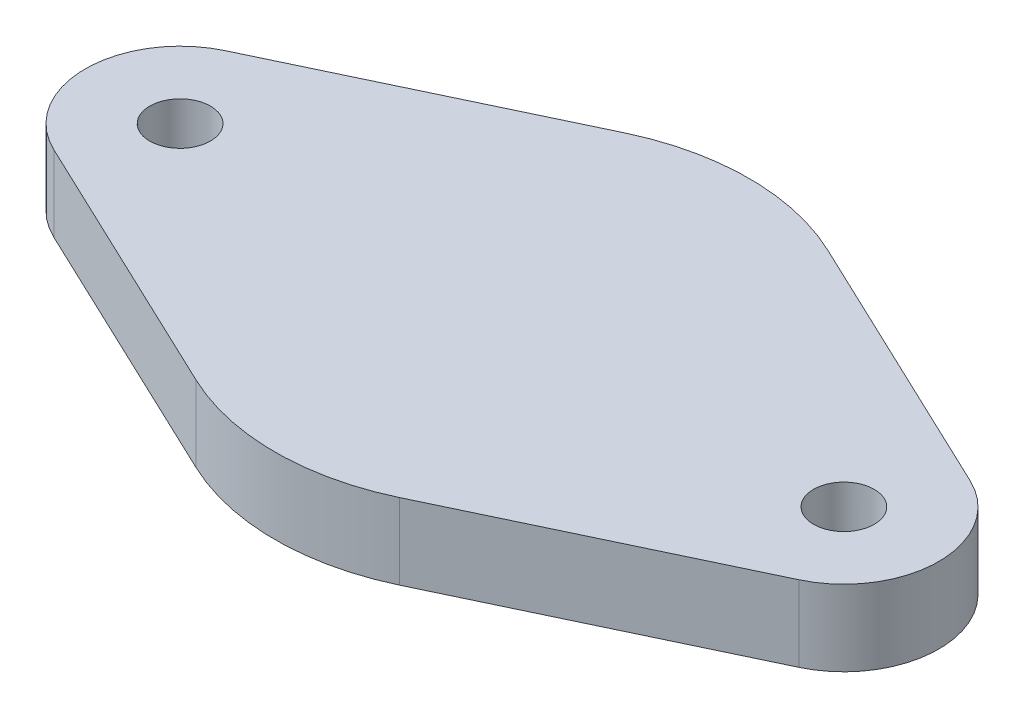
ISO-10303-21;
HEADER;
FILE_DESCRIPTION(('STEP AP214'),'2;1');
FILE_NAME('part.step','',(''),(''),'','','');
FILE_SCHEMA(('AUTOMOTIVE_DESIGN { 1 0 10303 214 1 1 1 1 }'));
ENDSEC;
DATA;
#1=APPLICATION_CONTEXT('core data for automotive mechanical design processes');
#2=APPLICATION_PROTOCOL_DEFINITION('international standard','automotive_design',2000,#1);
#3=PRODUCT_CONTEXT('',#1,'mechanical');
#4=PRODUCT('Part','Part','',(#3));
#5=PRODUCT_RELATED_PRODUCT_CATEGORY('part','',(#4));
#6=PRODUCT_DEFINITION_FORMATION('','',#4);
#7=PRODUCT_DEFINITION_CONTEXT('part definition',#1,'design');
#8=PRODUCT_DEFINITION('design','',#6,#7);
#9=PRODUCT_DEFINITION_SHAPE('','',#8);
#10=(LENGTH_UNIT() NAMED_UNIT(*) SI_UNIT(.MILLI.,.METRE.));
#11=(NAMED_UNIT(*) PLANE_ANGLE_UNIT() SI_UNIT($,.RADIAN.));
#12=(NAMED_UNIT(*) SI_UNIT($,.STERADIAN.) SOLID_ANGLE_UNIT());
#13=UNCERTAINTY_MEASURE_WITH_UNIT(LENGTH_MEASURE(1.E-05),#10,'distance_accuracy_value','');
#14=(GEOMETRIC_REPRESENTATION_CONTEXT(3) GLOBAL_UNCERTAINTY_ASSIGNED_CONTEXT((#13)) GLOBAL_UNIT_ASSIGNED_CONTEXT((#10,
#11,#12)) REPRESENTATION_CONTEXT('',''));
#15=CARTESIAN_POINT('',(0.,0.,0.));
#16=DIRECTION('',(0.,0.,1.));
#17=DIRECTION('',(1.,0.,0.));
#18=AXIS2_PLACEMENT_3D('',#15,#16,#17);
#19=CARTESIAN_POINT('',(0.,12.495,0.));
#20=DIRECTION('',(0.,1.,0.));
#21=DIRECTION('',(0.,0.,1.));
#22=AXIS2_PLACEMENT_3D('',#19,#20,#21);
#23=CYLINDRICAL_SURFACE('',#22,12.5);
#24=DIRECTION('',(0.,1.,0.));
#25=VECTOR('',#24,1.);
#26=CARTESIAN_POINT('',(5.35714285714285,-20.4563332018274,-11.2938487863156));
#27=LINE('',#26,#25);
#28=CARTESIAN_POINT('',(5.35714285714285,7.9,-11.2938487863156));
#29=VERTEX_POINT('',#28);
#30=CARTESIAN_POINT('',(5.35714285714286,11.9,-11.2938487863156));
#31=VERTEX_POINT('',#30);
#32=EDGE_CURVE('E188',#29,#31,#27,.T.);
#33=ORIENTED_EDGE('',*,*,#32,.F.);
#34=CARTESIAN_POINT('',(0.,7.9,0.));
#35=DIRECTION('',(0.,1.,0.));
#36=DIRECTION('',(0.,0.,1.));
#37=AXIS2_PLACEMENT_3D('',#34,#35,#36);
#38=CIRCLE('',#37,12.5);
#39=CARTESIAN_POINT('',(-5.35714285714285,7.9,-11.2938487863156));
#40=VERTEX_POINT('',#39);
#41=EDGE_CURVE('E131',#29,#40,#38,.T.);
#42=ORIENTED_EDGE('',*,*,#41,.T.);
#43=DIRECTION('',(0.,1.,0.));
#44=VECTOR('',#43,1.);
#45=CARTESIAN_POINT('',(-5.35714285714285,-20.4563332018274,-11.2938487863156));
#46=LINE('',#45,#44);
#47=CARTESIAN_POINT('',(-5.35714285714285,11.9,-11.2938487863156));
#48=VERTEX_POINT('',#47);
#49=EDGE_CURVE('E143',#40,#48,#46,.T.);
#50=ORIENTED_EDGE('',*,*,#49,.T.);
#51=CARTESIAN_POINT('',(0.,11.9,0.));
#52=DIRECTION('',(0.,1.,0.));
#53=DIRECTION('',(0.,0.,1.));
#54=AXIS2_PLACEMENT_3D('',#51,#52,#53);
#55=CIRCLE('',#54,12.5);
#56=EDGE_CURVE('E132',#31,#48,#55,.T.);
#57=ORIENTED_EDGE('',*,*,#56,.F.);
#58=EDGE_LOOP('',(#33,#42,#50,#57));
#59=FACE_BOUND('',#58,.T.);
#60=ADVANCED_FACE('F39',(#59),#23,.T.);
#61=CARTESIAN_POINT('',(0.,0.,0.));
#62=DIRECTION('',(0.,1.,0.));
#63=DIRECTION('',(1.,0.,0.));
#64=AXIS2_PLACEMENT_3D('',#61,#62,#63);
#65=SPHERICAL_SURFACE('',#64,10.25);
#66=CARTESIAN_POINT('',(0.,7.9,0.));
#67=DIRECTION('',(0.,1.,0.));
#68=DIRECTION('',(0.,0.,1.));
#69=AXIS2_PLACEMENT_3D('',#66,#67,#68);
#70=CIRCLE('',#69,6.53088814787086);
#71=CARTESIAN_POINT('',(0.,7.9,6.53088814787086));
#72=VERTEX_POINT('',#71);
#73=EDGE_CURVE('E11',#72,#72,#70,.T.);
#74=ORIENTED_EDGE('',*,*,#73,.F.);
#75=EDGE_LOOP('',(#74));
#76=FACE_BOUND('',#75,.T.);
#77=ADVANCED_FACE('F41',(#76),#65,.F.);
#78=CARTESIAN_POINT('',(0.,7.9,0.));
#79=DIRECTION('',(0.,1.,0.));
#80=DIRECTION('',(0.,0.,1.));
#81=AXIS2_PLACEMENT_3D('',#78,#79,#80);
#82=PLANE('',#81);
#83=CARTESIAN_POINT('',(-5.35714285714285,7.9,11.2938487863156));
#84=VERTEX_POINT('',#83);
#85=CARTESIAN_POINT('',(5.35714285714285,7.9,11.2938487863156));
#86=VERTEX_POINT('',#85);
#87=EDGE_CURVE('E48',#84,#86,#38,.T.);
#88=ORIENTED_EDGE('',*,*,#87,.F.);
#89=DIRECTION('',(-0.903507902905251,0.,-0.428571428571428));
#90=VECTOR('',#89,1.);
#91=CARTESIAN_POINT('',(-5.35714285714285,7.9,11.2938487863156));
#92=LINE('',#91,#90);
#93=CARTESIAN_POINT('',(-19.6428571428571,7.9,4.51753951452626));
#94=VERTEX_POINT('',#93);
#95=EDGE_CURVE('E171',#84,#94,#92,.T.);
#96=ORIENTED_EDGE('',*,*,#95,.T.);
#97=CARTESIAN_POINT('',(-17.5,7.9,0.));
#98=DIRECTION('',(0.,1.,0.));
#99=DIRECTION('',(0.,0.,1.));
#100=AXIS2_PLACEMENT_3D('',#97,#98,#99);
#101=CIRCLE('',#100,5.);
#102=CARTESIAN_POINT('',(-19.6428571428571,7.9,-4.51753951452626));
#103=VERTEX_POINT('',#102);
#104=EDGE_CURVE('E156',#94,#103,#101,.F.);
#105=ORIENTED_EDGE('',*,*,#104,.T.);
#106=DIRECTION('',(0.903507902905251,0.,-0.428571428571428));
#107=VECTOR('',#106,1.);
#108=CARTESIAN_POINT('',(-5.35714285714285,7.9,-11.2938487863156));
#109=LINE('',#108,#107);
#110=EDGE_CURVE('E142',#103,#40,#109,.T.);
#111=ORIENTED_EDGE('',*,*,#110,.T.);
#112=ORIENTED_EDGE('',*,*,#41,.F.);
#113=DIRECTION('',(0.903507902905251,0.,0.428571428571428));
#114=VECTOR('',#113,1.);
#115=CARTESIAN_POINT('',(5.35714285714285,7.9,-11.2938487863156));
#116=LINE('',#115,#114);
#117=CARTESIAN_POINT('',(19.6428571428571,7.9,-4.51753951452626));
#118=VERTEX_POINT('',#117);
#119=EDGE_CURVE('E199',#29,#118,#116,.T.);
#120=ORIENTED_EDGE('',*,*,#119,.T.);
#121=CARTESIAN_POINT('',(17.5,7.9,0.));
#122=DIRECTION('',(0.,1.,0.));
#123=DIRECTION('',(0.,0.,1.));
#124=AXIS2_PLACEMENT_3D('',#121,#122,#123);
#125=CIRCLE('',#124,5.);
#126=CARTESIAN_POINT('',(19.6428571428571,7.9,4.51753951452626));
#127=VERTEX_POINT('',#126);
#128=EDGE_CURVE('E191',#118,#127,#125,.F.);
#129=ORIENTED_EDGE('',*,*,#128,.T.);
#130=DIRECTION('',(-0.903507902905251,0.,0.428571428571428));
#131=VECTOR('',#130,1.);
#132=CARTESIAN_POINT('',(5.35714285714285,7.9,11.2938487863156));
#133=LINE('',#132,#131);
#134=EDGE_CURVE('E181',#127,#86,#133,.T.);
#135=ORIENTED_EDGE('',*,*,#134,.T.);
#136=EDGE_LOOP('',(#88,#96,#105,#111,#112,#120,#129,#135));
#137=FACE_BOUND('',#136,.T.);
#138=ORIENTED_EDGE('',*,*,#73,.T.);
#139=EDGE_LOOP('',(#138));
#140=FACE_BOUND('',#139,.T.);
#141=CARTESIAN_POINT('',(-17.5,7.9,0.));
#142=DIRECTION('',(0.,1.,0.));
#143=DIRECTION('',(0.,0.,1.));
#144=AXIS2_PLACEMENT_3D('',#141,#142,#143);
#145=CIRCLE('',#144,1.6);
#146=CARTESIAN_POINT('',(-17.5,7.9,1.6));
#147=VERTEX_POINT('',#146);
#148=EDGE_CURVE('E136',#147,#147,#145,.F.);
#149=ORIENTED_EDGE('',*,*,#148,.F.);
#150=EDGE_LOOP('',(#149));
#151=FACE_BOUND('',#150,.T.);
#152=CARTESIAN_POINT('',(17.5,7.9,0.));
#153=DIRECTION('',(0.,1.,0.));
#154=DIRECTION('',(0.,0.,1.));
#155=AXIS2_PLACEMENT_3D('',#152,#153,#154);
#156=CIRCLE('',#155,1.6);
#157=CARTESIAN_POINT('',(17.5,7.9,1.6));
#158=VERTEX_POINT('',#157);
#159=EDGE_CURVE('E170',#158,#158,#156,.F.);
#160=ORIENTED_EDGE('',*,*,#159,.F.);
#161=EDGE_LOOP('',(#160));
#162=FACE_BOUND('',#161,.T.);
#163=ADVANCED_FACE('F206',(#137,#140,#151,#162),#82,.F.);
#164=ORIENTED_EDGE('',*,*,#87,.T.);
#165=DIRECTION('',(0.,1.,0.));
#166=VECTOR('',#165,1.);
#167=CARTESIAN_POINT('',(5.35714285714285,-20.4563332018274,11.2938487863156));
#168=LINE('',#167,#166);
#169=CARTESIAN_POINT('',(5.35714285714285,11.9,11.2938487863156));
#170=VERTEX_POINT('',#169);
#171=EDGE_CURVE('E111',#86,#170,#168,.T.);
#172=ORIENTED_EDGE('',*,*,#171,.T.);
#173=CARTESIAN_POINT('',(-5.35714285714286,11.9,11.2938487863156));
#174=VERTEX_POINT('',#173);
#175=EDGE_CURVE('E124',#174,#170,#55,.T.);
#176=ORIENTED_EDGE('',*,*,#175,.F.);
#177=DIRECTION('',(0.,1.,0.));
#178=VECTOR('',#177,1.);
#179=CARTESIAN_POINT('',(-5.35714285714285,-20.4563332018274,11.2938487863156));
#180=LINE('',#179,#178);
#181=EDGE_CURVE('E153',#84,#174,#180,.T.);
#182=ORIENTED_EDGE('',*,*,#181,.F.);
#183=EDGE_LOOP('',(#164,#172,#176,#182));
#184=FACE_BOUND('',#183,.T.);
#185=ADVANCED_FACE('F122',(#184),#23,.T.);
#186=CARTESIAN_POINT('',(0.,11.9,0.));
#187=DIRECTION('',(0.,1.,0.));
#188=DIRECTION('',(0.,0.,1.));
#189=AXIS2_PLACEMENT_3D('',#186,#187,#188);
#190=PLANE('',#189);
#191=ORIENTED_EDGE('',*,*,#175,.T.);
#192=DIRECTION('',(0.903507902905252,0.,-0.428571428571428));
#193=VECTOR('',#192,1.);
#194=CARTESIAN_POINT('',(5.35714285714285,11.9,11.2938487863156));
#195=LINE('',#194,#193);
#196=CARTESIAN_POINT('',(19.6428571428571,11.9,4.51753951452626));
#197=VERTEX_POINT('',#196);
#198=EDGE_CURVE('E107',#170,#197,#195,.T.);
#199=ORIENTED_EDGE('',*,*,#198,.T.);
#200=CARTESIAN_POINT('',(17.5,11.9,0.));
#201=DIRECTION('',(0.,1.,0.));
#202=DIRECTION('',(0.,0.,-1.));
#203=AXIS2_PLACEMENT_3D('',#200,#201,#202);
#204=CIRCLE('',#203,5.);
#205=CARTESIAN_POINT('',(19.6428571428571,11.9,-4.51753951452626));
#206=VERTEX_POINT('',#205);
#207=EDGE_CURVE('E117',#197,#206,#204,.T.);
#208=ORIENTED_EDGE('',*,*,#207,.T.);
#209=DIRECTION('',(-0.903507902905252,0.,-0.428571428571428));
#210=VECTOR('',#209,1.);
#211=CARTESIAN_POINT('',(5.35714285714285,11.9,-11.2938487863156));
#212=LINE('',#211,#210);
#213=EDGE_CURVE('E55',#206,#31,#212,.T.);
#214=ORIENTED_EDGE('',*,*,#213,.T.);
#215=ORIENTED_EDGE('',*,*,#56,.T.);
#216=DIRECTION('',(-0.903507902905252,0.,0.428571428571428));
#217=VECTOR('',#216,1.);
#218=CARTESIAN_POINT('',(-5.35714285714285,11.9,-11.2938487863156));
#219=LINE('',#218,#217);
#220=CARTESIAN_POINT('',(-19.6428571428571,11.9,-4.51753951452626));
#221=VERTEX_POINT('',#220);
#222=EDGE_CURVE('E162',#48,#221,#219,.T.);
#223=ORIENTED_EDGE('',*,*,#222,.T.);
#224=CARTESIAN_POINT('',(-17.5,11.9,0.));
#225=DIRECTION('',(0.,1.,0.));
#226=DIRECTION('',(0.,0.,1.));
#227=AXIS2_PLACEMENT_3D('',#224,#225,#226);
#228=CIRCLE('',#227,5.);
#229=CARTESIAN_POINT('',(-19.6428571428571,11.9,4.51753951452626));
#230=VERTEX_POINT('',#229);
#231=EDGE_CURVE('E159',#221,#230,#228,.T.);
#232=ORIENTED_EDGE('',*,*,#231,.T.);
#233=DIRECTION('',(0.903507902905252,0.,0.428571428571428));
#234=VECTOR('',#233,1.);
#235=CARTESIAN_POINT('',(-5.35714285714285,11.9,11.2938487863156));
#236=LINE('',#235,#234);
#237=EDGE_CURVE('E62',#230,#174,#236,.T.);
#238=ORIENTED_EDGE('',*,*,#237,.T.);
#239=EDGE_LOOP('',(#191,#199,#208,#214,#215,#223,#232,#238));
#240=FACE_BOUND('',#239,.T.);
#241=CARTESIAN_POINT('',(-17.5,11.9,0.));
#242=DIRECTION('',(0.,1.,0.));
#243=DIRECTION('',(0.,0.,1.));
#244=AXIS2_PLACEMENT_3D('',#241,#242,#243);
#245=CIRCLE('',#244,1.6);
#246=CARTESIAN_POINT('',(-17.5,11.9,1.6));
#247=VERTEX_POINT('',#246);
#248=EDGE_CURVE('E166',#247,#247,#245,.T.);
#249=ORIENTED_EDGE('',*,*,#248,.F.);
#250=EDGE_LOOP('',(#249));
#251=FACE_BOUND('',#250,.T.);
#252=CARTESIAN_POINT('',(17.5,11.9,0.));
#253=DIRECTION('',(0.,1.,0.));
#254=DIRECTION('',(0.,0.,-1.));
#255=AXIS2_PLACEMENT_3D('',#252,#253,#254);
#256=CIRCLE('',#255,1.6);
#257=CARTESIAN_POINT('',(17.5,11.9,-1.6));
#258=VERTEX_POINT('',#257);
#259=EDGE_CURVE('E118',#258,#258,#256,.T.);
#260=ORIENTED_EDGE('',*,*,#259,.F.);
#261=EDGE_LOOP('',(#260));
#262=FACE_BOUND('',#261,.T.);
#263=ADVANCED_FACE('F128',(#240,#251,#262),#190,.T.);
#264=CARTESIAN_POINT('',(-5.35714285714285,-20.4563332018274,-11.2938487863156));
#265=DIRECTION('',(-0.428571428571428,0.,-0.903507902905251));
#266=DIRECTION('',(-0.903507902905251,0.,0.428571428571428));
#267=AXIS2_PLACEMENT_3D('',#264,#265,#266);
#268=PLANE('',#267);
#269=ORIENTED_EDGE('',*,*,#110,.F.);
#270=DIRECTION('',(0.,1.,0.));
#271=VECTOR('',#270,1.);
#272=CARTESIAN_POINT('',(-19.6428571428571,-20.4563332018274,-4.51753951452626));
#273=LINE('',#272,#271);
#274=EDGE_CURVE('E147',#103,#221,#273,.T.);
#275=ORIENTED_EDGE('',*,*,#274,.T.);
#276=ORIENTED_EDGE('',*,*,#222,.F.);
#277=ORIENTED_EDGE('',*,*,#49,.F.);
#278=EDGE_LOOP('',(#269,#275,#276,#277));
#279=FACE_BOUND('',#278,.T.);
#280=ADVANCED_FACE('F222',(#279),#268,.T.);
#281=CARTESIAN_POINT('',(-17.5,-20.4563332018274,0.));
#282=DIRECTION('',(0.,1.,0.));
#283=DIRECTION('',(0.,0.,1.));
#284=AXIS2_PLACEMENT_3D('',#281,#282,#283);
#285=CYLINDRICAL_SURFACE('',#284,5.);
#286=ORIENTED_EDGE('',*,*,#104,.F.);
#287=DIRECTION('',(0.,1.,0.));
#288=VECTOR('',#287,1.);
#289=CARTESIAN_POINT('',(-19.6428571428571,-20.4563332018274,4.51753951452626));
#290=LINE('',#289,#288);
#291=EDGE_CURVE('E150',#94,#230,#290,.T.);
#292=ORIENTED_EDGE('',*,*,#291,.T.);
#293=ORIENTED_EDGE('',*,*,#231,.F.);
#294=ORIENTED_EDGE('',*,*,#274,.F.);
#295=EDGE_LOOP('',(#286,#292,#293,#294));
#296=FACE_BOUND('',#295,.T.);
#297=ADVANCED_FACE('F227',(#296),#285,.T.);
#298=CARTESIAN_POINT('',(-5.35714285714285,-20.4563332018274,11.2938487863156));
#299=DIRECTION('',(-0.428571428571428,0.,0.903507902905251));
#300=DIRECTION('',(0.903507902905251,0.,0.428571428571428));
#301=AXIS2_PLACEMENT_3D('',#298,#299,#300);
#302=PLANE('',#301);
#303=ORIENTED_EDGE('',*,*,#95,.F.);
#304=ORIENTED_EDGE('',*,*,#181,.T.);
#305=ORIENTED_EDGE('',*,*,#237,.F.);
#306=ORIENTED_EDGE('',*,*,#291,.F.);
#307=EDGE_LOOP('',(#303,#304,#305,#306));
#308=FACE_BOUND('',#307,.T.);
#309=ADVANCED_FACE('F230',(#308),#302,.T.);
#310=CARTESIAN_POINT('',(-17.5,-20.4563332018274,0.));
#311=DIRECTION('',(0.,1.,0.));
#312=DIRECTION('',(0.,0.,1.));
#313=AXIS2_PLACEMENT_3D('',#310,#311,#312);
#314=CYLINDRICAL_SURFACE('',#313,1.6);
#315=ORIENTED_EDGE('',*,*,#148,.T.);
#316=EDGE_LOOP('',(#315));
#317=FACE_BOUND('',#316,.T.);
#318=ORIENTED_EDGE('',*,*,#248,.T.);
#319=EDGE_LOOP('',(#318));
#320=FACE_BOUND('',#319,.T.);
#321=ADVANCED_FACE('F232',(#317,#320),#314,.F.);
#322=CARTESIAN_POINT('',(5.35714285714285,-20.4563332018274,11.2938487863156));
#323=DIRECTION('',(0.428571428571428,0.,0.903507902905251));
#324=DIRECTION('',(0.903507902905251,0.,-0.428571428571428));
#325=AXIS2_PLACEMENT_3D('',#322,#323,#324);
#326=PLANE('',#325);
#327=ORIENTED_EDGE('',*,*,#134,.F.);
#328=DIRECTION('',(0.,1.,0.));
#329=VECTOR('',#328,1.);
#330=CARTESIAN_POINT('',(19.6428571428571,-20.4563332018274,4.51753951452626));
#331=LINE('',#330,#329);
#332=EDGE_CURVE('E114',#127,#197,#331,.T.);
#333=ORIENTED_EDGE('',*,*,#332,.T.);
#334=ORIENTED_EDGE('',*,*,#198,.F.);
#335=ORIENTED_EDGE('',*,*,#171,.F.);
#336=EDGE_LOOP('',(#327,#333,#334,#335));
#337=FACE_BOUND('',#336,.T.);
#338=ADVANCED_FACE('F110',(#337),#326,.T.);
#339=CARTESIAN_POINT('',(17.5,-20.4563332018274,0.));
#340=DIRECTION('',(0.,1.,0.));
#341=DIRECTION('',(0.,0.,1.));
#342=AXIS2_PLACEMENT_3D('',#339,#340,#341);
#343=CYLINDRICAL_SURFACE('',#342,5.);
#344=ORIENTED_EDGE('',*,*,#128,.F.);
#345=DIRECTION('',(0.,1.,0.));
#346=VECTOR('',#345,1.);
#347=CARTESIAN_POINT('',(19.6428571428571,-20.4563332018274,-4.51753951452626));
#348=LINE('',#347,#346);
#349=EDGE_CURVE('E185',#118,#206,#348,.T.);
#350=ORIENTED_EDGE('',*,*,#349,.T.);
#351=ORIENTED_EDGE('',*,*,#207,.F.);
#352=ORIENTED_EDGE('',*,*,#332,.F.);
#353=EDGE_LOOP('',(#344,#350,#351,#352));
#354=FACE_BOUND('',#353,.T.);
#355=ADVANCED_FACE('F212',(#354),#343,.T.);
#356=CARTESIAN_POINT('',(5.35714285714285,-20.4563332018274,-11.2938487863156));
#357=DIRECTION('',(0.428571428571428,0.,-0.903507902905251));
#358=DIRECTION('',(-0.903507902905251,0.,-0.428571428571428));
#359=AXIS2_PLACEMENT_3D('',#356,#357,#358);
#360=PLANE('',#359);
#361=ORIENTED_EDGE('',*,*,#119,.F.);
#362=ORIENTED_EDGE('',*,*,#32,.T.);
#363=ORIENTED_EDGE('',*,*,#213,.F.);
#364=ORIENTED_EDGE('',*,*,#349,.F.);
#365=EDGE_LOOP('',(#361,#362,#363,#364));
#366=FACE_BOUND('',#365,.T.);
#367=ADVANCED_FACE('F214',(#366),#360,.T.);
#368=CARTESIAN_POINT('',(17.5,-20.4563332018274,0.));
#369=DIRECTION('',(0.,1.,0.));
#370=DIRECTION('',(0.,0.,1.));
#371=AXIS2_PLACEMENT_3D('',#368,#369,#370);
#372=CYLINDRICAL_SURFACE('',#371,1.6);
#373=ORIENTED_EDGE('',*,*,#159,.T.);
#374=EDGE_LOOP('',(#373));
#375=FACE_BOUND('',#374,.T.);
#376=ORIENTED_EDGE('',*,*,#259,.T.);
#377=EDGE_LOOP('',(#376));
#378=FACE_BOUND('',#377,.T.);
#379=ADVANCED_FACE('F329',(#375,#378),#372,.F.);
#380=CLOSED_SHELL('',(#60,#77,#163,#185,#263,#280,#297,#309,#321,#338,#355,#367,#379));
#381=MANIFOLD_SOLID_BREP('B2',#380);
#382=ADVANCED_BREP_SHAPE_REPRESENTATION('',(#18,#381),#14);
#383=SHAPE_DEFINITION_REPRESENTATION(#9,#382);
ENDSEC;
END-ISO-10303-21;
